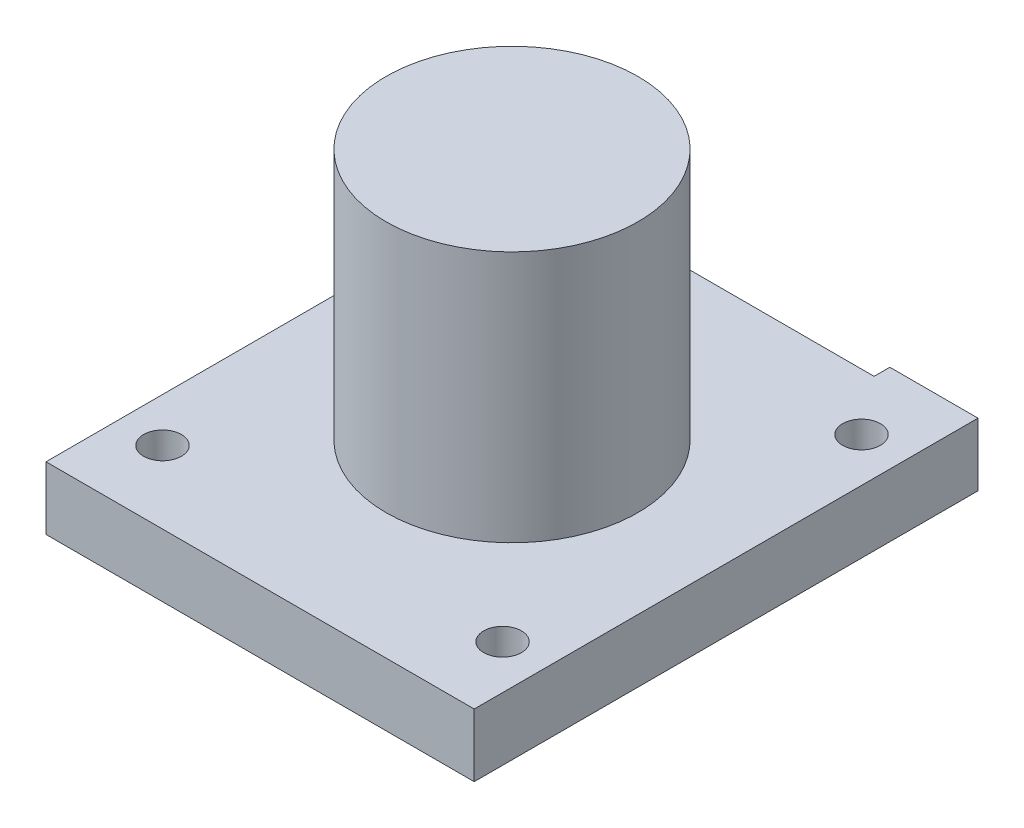
ISO-10303-21;
HEADER;
FILE_DESCRIPTION(('STEP AP214'),'2;1');
FILE_NAME('part.step','',(''),(''),'','','');
FILE_SCHEMA(('AUTOMOTIVE_DESIGN { 1 0 10303 214 1 1 1 1 }'));
ENDSEC;
DATA;
#1=APPLICATION_CONTEXT('core data for automotive mechanical design processes');
#2=APPLICATION_PROTOCOL_DEFINITION('international standard','automotive_design',2000,#1);
#3=PRODUCT_CONTEXT('',#1,'mechanical');
#4=PRODUCT('Part','Part','',(#3));
#5=PRODUCT_RELATED_PRODUCT_CATEGORY('part','',(#4));
#6=PRODUCT_DEFINITION_FORMATION('','',#4);
#7=PRODUCT_DEFINITION_CONTEXT('part definition',#1,'design');
#8=PRODUCT_DEFINITION('design','',#6,#7);
#9=PRODUCT_DEFINITION_SHAPE('','',#8);
#10=(LENGTH_UNIT() NAMED_UNIT(*) SI_UNIT(.MILLI.,.METRE.));
#11=(NAMED_UNIT(*) PLANE_ANGLE_UNIT() SI_UNIT($,.RADIAN.));
#12=(NAMED_UNIT(*) SI_UNIT($,.STERADIAN.) SOLID_ANGLE_UNIT());
#13=UNCERTAINTY_MEASURE_WITH_UNIT(LENGTH_MEASURE(1.E-05),#10,'distance_accuracy_value','');
#14=(GEOMETRIC_REPRESENTATION_CONTEXT(3) GLOBAL_UNCERTAINTY_ASSIGNED_CONTEXT((#13)) GLOBAL_UNIT_ASSIGNED_CONTEXT((#10,
#11,#12)) REPRESENTATION_CONTEXT('',''));
#15=CARTESIAN_POINT('',(0.,0.,0.));
#16=DIRECTION('',(0.,0.,1.));
#17=DIRECTION('',(1.,0.,0.));
#18=AXIS2_PLACEMENT_3D('',#15,#16,#17);
#19=CARTESIAN_POINT('',(0.,-5.,-32.));
#20=DIRECTION('',(0.,0.,-1.));
#21=DIRECTION('',(-1.,0.,0.));
#22=AXIS2_PLACEMENT_3D('',#19,#20,#21);
#23=PLANE('',#22);
#24=DIRECTION('',(-1.,0.,0.));
#25=VECTOR('',#24,1.);
#26=CARTESIAN_POINT('',(0.,0.,-32.));
#27=LINE('',#26,#25);
#28=CARTESIAN_POINT('',(2.,0.,-32.));
#29=VERTEX_POINT('',#28);
#30=CARTESIAN_POINT('',(-5.,0.,-32.));
#31=VERTEX_POINT('',#30);
#32=EDGE_CURVE('E153',#29,#31,#27,.T.);
#33=ORIENTED_EDGE('',*,*,#32,.F.);
#34=DIRECTION('',(0.,1.,0.));
#35=VECTOR('',#34,1.);
#36=CARTESIAN_POINT('',(2.,-5.,-32.));
#37=LINE('',#36,#35);
#38=CARTESIAN_POINT('',(2.,-5.,-32.));
#39=VERTEX_POINT('',#38);
#40=EDGE_CURVE('E12',#39,#29,#37,.T.);
#41=ORIENTED_EDGE('',*,*,#40,.F.);
#42=DIRECTION('',(-1.,0.,0.));
#43=VECTOR('',#42,1.);
#44=CARTESIAN_POINT('',(0.,-5.,-32.));
#45=LINE('',#44,#43);
#46=CARTESIAN_POINT('',(-5.,-5.,-32.));
#47=VERTEX_POINT('',#46);
#48=EDGE_CURVE('E176',#39,#47,#45,.T.);
#49=ORIENTED_EDGE('',*,*,#48,.T.);
#50=DIRECTION('',(0.,1.,0.));
#51=VECTOR('',#50,1.);
#52=CARTESIAN_POINT('',(-5.,-5.,-32.));
#53=LINE('',#52,#51);
#54=EDGE_CURVE('E49',#47,#31,#53,.T.);
#55=ORIENTED_EDGE('',*,*,#54,.T.);
#56=EDGE_LOOP('',(#33,#41,#49,#55));
#57=FACE_BOUND('',#56,.T.);
#58=ADVANCED_FACE('F45',(#57),#23,.T.);
#59=CARTESIAN_POINT('',(2.,-5.,0.));
#60=DIRECTION('',(1.,0.,0.));
#61=DIRECTION('',(0.,0.,-1.));
#62=AXIS2_PLACEMENT_3D('',#59,#60,#61);
#63=PLANE('',#62);
#64=DIRECTION('',(0.,0.,-1.));
#65=VECTOR('',#64,1.);
#66=CARTESIAN_POINT('',(2.,0.,0.));
#67=LINE('',#66,#65);
#68=CARTESIAN_POINT('',(2.,0.,-30.75));
#69=VERTEX_POINT('',#68);
#70=EDGE_CURVE('E171',#69,#29,#67,.T.);
#71=ORIENTED_EDGE('',*,*,#70,.F.);
#72=DIRECTION('',(0.,1.,0.));
#73=VECTOR('',#72,1.);
#74=CARTESIAN_POINT('',(2.,-5.,-30.75));
#75=LINE('',#74,#73);
#76=CARTESIAN_POINT('',(2.,-5.,-30.75));
#77=VERTEX_POINT('',#76);
#78=EDGE_CURVE('E55',#77,#69,#75,.T.);
#79=ORIENTED_EDGE('',*,*,#78,.F.);
#80=DIRECTION('',(0.,0.,-1.));
#81=VECTOR('',#80,1.);
#82=CARTESIAN_POINT('',(2.,-5.,0.));
#83=LINE('',#82,#81);
#84=EDGE_CURVE('E133',#77,#39,#83,.T.);
#85=ORIENTED_EDGE('',*,*,#84,.T.);
#86=ORIENTED_EDGE('',*,*,#40,.T.);
#87=EDGE_LOOP('',(#71,#79,#85,#86));
#88=FACE_BOUND('',#87,.T.);
#89=ADVANCED_FACE('F203',(#88),#63,.T.);
#90=CARTESIAN_POINT('',(0.,-5.,-30.75));
#91=DIRECTION('',(0.,0.,1.));
#92=DIRECTION('',(1.,0.,0.));
#93=AXIS2_PLACEMENT_3D('',#90,#91,#92);
#94=PLANE('',#93);
#95=DIRECTION('',(1.,0.,0.));
#96=VECTOR('',#95,1.);
#97=CARTESIAN_POINT('',(0.,0.,-30.75));
#98=LINE('',#97,#96);
#99=CARTESIAN_POINT('',(22.,0.,-30.75));
#100=VERTEX_POINT('',#99);
#101=EDGE_CURVE('E136',#69,#100,#98,.T.);
#102=ORIENTED_EDGE('',*,*,#101,.T.);
#103=DIRECTION('',(0.,1.,0.));
#104=VECTOR('',#103,1.);
#105=CARTESIAN_POINT('',(22.,-5.,-30.75));
#106=LINE('',#105,#104);
#107=CARTESIAN_POINT('',(22.,-5.,-30.75));
#108=VERTEX_POINT('',#107);
#109=EDGE_CURVE('E124',#108,#100,#106,.T.);
#110=ORIENTED_EDGE('',*,*,#109,.F.);
#111=DIRECTION('',(1.,0.,0.));
#112=VECTOR('',#111,1.);
#113=CARTESIAN_POINT('',(0.,-5.,-30.75));
#114=LINE('',#113,#112);
#115=EDGE_CURVE('E128',#77,#108,#114,.T.);
#116=ORIENTED_EDGE('',*,*,#115,.F.);
#117=ORIENTED_EDGE('',*,*,#78,.T.);
#118=EDGE_LOOP('',(#102,#110,#116,#117));
#119=FACE_BOUND('',#118,.T.);
#120=ADVANCED_FACE('F135',(#119),#94,.F.);
#121=CARTESIAN_POINT('',(22.,-5.,0.));
#122=DIRECTION('',(1.,0.,0.));
#123=DIRECTION('',(0.,0.,-1.));
#124=AXIS2_PLACEMENT_3D('',#121,#122,#123);
#125=PLANE('',#124);
#126=DIRECTION('',(0.,0.,-1.));
#127=VECTOR('',#126,1.);
#128=CARTESIAN_POINT('',(22.,0.,0.));
#129=LINE('',#128,#127);
#130=CARTESIAN_POINT('',(22.,0.,-32.));
#131=VERTEX_POINT('',#130);
#132=EDGE_CURVE('E168',#100,#131,#129,.T.);
#133=ORIENTED_EDGE('',*,*,#132,.T.);
#134=DIRECTION('',(0.,1.,0.));
#135=VECTOR('',#134,1.);
#136=CARTESIAN_POINT('',(22.,-5.,-32.));
#137=LINE('',#136,#135);
#138=CARTESIAN_POINT('',(22.,-5.,-32.));
#139=VERTEX_POINT('',#138);
#140=EDGE_CURVE('E125',#139,#131,#137,.T.);
#141=ORIENTED_EDGE('',*,*,#140,.F.);
#142=DIRECTION('',(0.,0.,-1.));
#143=VECTOR('',#142,1.);
#144=CARTESIAN_POINT('',(22.,-5.,0.));
#145=LINE('',#144,#143);
#146=EDGE_CURVE('E119',#108,#139,#145,.T.);
#147=ORIENTED_EDGE('',*,*,#146,.F.);
#148=ORIENTED_EDGE('',*,*,#109,.T.);
#149=EDGE_LOOP('',(#133,#141,#147,#148));
#150=FACE_BOUND('',#149,.T.);
#151=ADVANCED_FACE('F122',(#150),#125,.F.);
#152=CARTESIAN_POINT('',(0.,-5.,-32.));
#153=DIRECTION('',(0.,0.,-1.));
#154=DIRECTION('',(-1.,0.,0.));
#155=AXIS2_PLACEMENT_3D('',#152,#153,#154);
#156=PLANE('',#155);
#157=DIRECTION('',(-1.,0.,0.));
#158=VECTOR('',#157,1.);
#159=CARTESIAN_POINT('',(0.,0.,-32.));
#160=LINE('',#159,#158);
#161=CARTESIAN_POINT('',(29.,0.,-32.));
#162=VERTEX_POINT('',#161);
#163=EDGE_CURVE('E165',#162,#131,#160,.T.);
#164=ORIENTED_EDGE('',*,*,#163,.F.);
#165=DIRECTION('',(0.,1.,0.));
#166=VECTOR('',#165,1.);
#167=CARTESIAN_POINT('',(29.,-5.,-32.));
#168=LINE('',#167,#166);
#169=CARTESIAN_POINT('',(29.,-5.,-32.));
#170=VERTEX_POINT('',#169);
#171=EDGE_CURVE('E139',#170,#162,#168,.T.);
#172=ORIENTED_EDGE('',*,*,#171,.F.);
#173=DIRECTION('',(-1.,0.,0.));
#174=VECTOR('',#173,1.);
#175=CARTESIAN_POINT('',(0.,-5.,-32.));
#176=LINE('',#175,#174);
#177=EDGE_CURVE('E129',#170,#139,#176,.T.);
#178=ORIENTED_EDGE('',*,*,#177,.T.);
#179=ORIENTED_EDGE('',*,*,#140,.T.);
#180=EDGE_LOOP('',(#164,#172,#178,#179));
#181=FACE_BOUND('',#180,.T.);
#182=ADVANCED_FACE('F193',(#181),#156,.T.);
#183=CARTESIAN_POINT('',(29.,-5.,0.));
#184=DIRECTION('',(1.,0.,0.));
#185=DIRECTION('',(0.,0.,-1.));
#186=AXIS2_PLACEMENT_3D('',#183,#184,#185);
#187=PLANE('',#186);
#188=DIRECTION('',(0.,0.,-1.));
#189=VECTOR('',#188,1.);
#190=CARTESIAN_POINT('',(29.,0.,0.));
#191=LINE('',#190,#189);
#192=CARTESIAN_POINT('',(29.,0.,8.00000000000001));
#193=VERTEX_POINT('',#192);
#194=EDGE_CURVE('E162',#193,#162,#191,.T.);
#195=ORIENTED_EDGE('',*,*,#194,.F.);
#196=DIRECTION('',(0.,1.,0.));
#197=VECTOR('',#196,1.);
#198=CARTESIAN_POINT('',(29.,-5.,8.00000000000001));
#199=LINE('',#198,#197);
#200=CARTESIAN_POINT('',(29.,-5.,8.00000000000001));
#201=VERTEX_POINT('',#200);
#202=EDGE_CURVE('E143',#201,#193,#199,.T.);
#203=ORIENTED_EDGE('',*,*,#202,.F.);
#204=DIRECTION('',(0.,0.,-1.));
#205=VECTOR('',#204,1.);
#206=CARTESIAN_POINT('',(29.,-5.,0.));
#207=LINE('',#206,#205);
#208=EDGE_CURVE('E188',#201,#170,#207,.T.);
#209=ORIENTED_EDGE('',*,*,#208,.T.);
#210=ORIENTED_EDGE('',*,*,#171,.T.);
#211=EDGE_LOOP('',(#195,#203,#209,#210));
#212=FACE_BOUND('',#211,.T.);
#213=ADVANCED_FACE('F197',(#212),#187,.T.);
#214=CARTESIAN_POINT('',(0.,-5.,8.));
#215=DIRECTION('',(0.,0.,1.));
#216=DIRECTION('',(1.,0.,0.));
#217=AXIS2_PLACEMENT_3D('',#214,#215,#216);
#218=PLANE('',#217);
#219=DIRECTION('',(1.,0.,0.));
#220=VECTOR('',#219,1.);
#221=CARTESIAN_POINT('',(0.,0.,8.));
#222=LINE('',#221,#220);
#223=CARTESIAN_POINT('',(-5.,0.,8.));
#224=VERTEX_POINT('',#223);
#225=EDGE_CURVE('E159',#224,#193,#222,.T.);
#226=ORIENTED_EDGE('',*,*,#225,.F.);
#227=DIRECTION('',(0.,1.,0.));
#228=VECTOR('',#227,1.);
#229=CARTESIAN_POINT('',(-5.,-5.,8.));
#230=LINE('',#229,#228);
#231=CARTESIAN_POINT('',(-5.,-5.,8.));
#232=VERTEX_POINT('',#231);
#233=EDGE_CURVE('E144',#232,#224,#230,.T.);
#234=ORIENTED_EDGE('',*,*,#233,.F.);
#235=DIRECTION('',(1.,0.,0.));
#236=VECTOR('',#235,1.);
#237=CARTESIAN_POINT('',(0.,-5.,8.));
#238=LINE('',#237,#236);
#239=EDGE_CURVE('E185',#232,#201,#238,.T.);
#240=ORIENTED_EDGE('',*,*,#239,.T.);
#241=ORIENTED_EDGE('',*,*,#202,.T.);
#242=EDGE_LOOP('',(#226,#234,#240,#241));
#243=FACE_BOUND('',#242,.T.);
#244=ADVANCED_FACE('F200',(#243),#218,.T.);
#245=CARTESIAN_POINT('',(12.,-5.,-12.));
#246=DIRECTION('',(0.,1.,0.));
#247=DIRECTION('',(0.,0.,1.));
#248=AXIS2_PLACEMENT_3D('',#245,#246,#247);
#249=CYLINDRICAL_SURFACE('',#248,10.);
#250=CARTESIAN_POINT('',(12.,-5.,-12.));
#251=DIRECTION('',(0.,1.,0.));
#252=DIRECTION('',(0.,0.,1.));
#253=AXIS2_PLACEMENT_3D('',#250,#251,#252);
#254=CIRCLE('',#253,10.);
#255=CARTESIAN_POINT('',(12.,-5.,-1.99999999999999));
#256=VERTEX_POINT('',#255);
#257=EDGE_CURVE('E173',#256,#256,#254,.T.);
#258=ORIENTED_EDGE('',*,*,#257,.F.);
#259=EDGE_LOOP('',(#258));
#260=FACE_BOUND('',#259,.T.);
#261=CARTESIAN_POINT('',(12.,0.,-12.));
#262=DIRECTION('',(0.,1.,0.));
#263=DIRECTION('',(0.,0.,1.));
#264=AXIS2_PLACEMENT_3D('',#261,#262,#263);
#265=CIRCLE('',#264,10.);
#266=CARTESIAN_POINT('',(12.,0.,-1.99999999999999));
#267=VERTEX_POINT('',#266);
#268=EDGE_CURVE('E150',#267,#267,#265,.T.);
#269=ORIENTED_EDGE('',*,*,#268,.T.);
#270=EDGE_LOOP('',(#269));
#271=FACE_BOUND('',#270,.T.);
#272=ADVANCED_FACE('F47',(#260,#271),#249,.F.);
#273=CARTESIAN_POINT('',(-5.,-5.,0.));
#274=DIRECTION('',(1.,0.,0.));
#275=DIRECTION('',(0.,0.,-1.));
#276=AXIS2_PLACEMENT_3D('',#273,#274,#275);
#277=PLANE('',#276);
#278=DIRECTION('',(0.,0.,-1.));
#279=VECTOR('',#278,1.);
#280=CARTESIAN_POINT('',(-5.,0.,0.));
#281=LINE('',#280,#279);
#282=EDGE_CURVE('E157',#224,#31,#281,.T.);
#283=ORIENTED_EDGE('',*,*,#282,.T.);
#284=ORIENTED_EDGE('',*,*,#54,.F.);
#285=DIRECTION('',(0.,0.,-1.));
#286=VECTOR('',#285,1.);
#287=CARTESIAN_POINT('',(-5.,-5.,0.));
#288=LINE('',#287,#286);
#289=EDGE_CURVE('E102',#232,#47,#288,.T.);
#290=ORIENTED_EDGE('',*,*,#289,.F.);
#291=ORIENTED_EDGE('',*,*,#233,.T.);
#292=EDGE_LOOP('',(#283,#284,#290,#291));
#293=FACE_BOUND('',#292,.T.);
#294=ADVANCED_FACE('F201',(#293),#277,.F.);
#295=CARTESIAN_POINT('',(0.,-5.,0.));
#296=DIRECTION('',(0.,1.,0.));
#297=DIRECTION('',(0.,0.,1.));
#298=AXIS2_PLACEMENT_3D('',#295,#296,#297);
#299=PLANE('',#298);
#300=CARTESIAN_POINT('',(-1.50000000000001,-5.,2.24999999999999));
#301=DIRECTION('',(0.,1.,0.));
#302=DIRECTION('',(0.,0.,1.));
#303=AXIS2_PLACEMENT_3D('',#300,#301,#302);
#304=CIRCLE('',#303,1.5);
#305=CARTESIAN_POINT('',(-1.50000000000001,-5.,3.74999999999999));
#306=VERTEX_POINT('',#305);
#307=EDGE_CURVE('E251',#306,#306,#304,.T.);
#308=ORIENTED_EDGE('',*,*,#307,.T.);
#309=EDGE_LOOP('',(#308));
#310=FACE_BOUND('',#309,.T.);
#311=CARTESIAN_POINT('',(25.5,-5.,2.24999999999999));
#312=DIRECTION('',(0.,1.,0.));
#313=DIRECTION('',(0.,0.,1.));
#314=AXIS2_PLACEMENT_3D('',#311,#312,#313);
#315=CIRCLE('',#314,1.5);
#316=CARTESIAN_POINT('',(25.5,-5.,3.74999999999999));
#317=VERTEX_POINT('',#316);
#318=EDGE_CURVE('E253',#317,#317,#315,.T.);
#319=ORIENTED_EDGE('',*,*,#318,.T.);
#320=EDGE_LOOP('',(#319));
#321=FACE_BOUND('',#320,.T.);
#322=CARTESIAN_POINT('',(25.5,-5.,-26.25));
#323=DIRECTION('',(0.,1.,0.));
#324=DIRECTION('',(0.,0.,1.));
#325=AXIS2_PLACEMENT_3D('',#322,#323,#324);
#326=CIRCLE('',#325,1.5);
#327=CARTESIAN_POINT('',(25.5,-5.,-24.75));
#328=VERTEX_POINT('',#327);
#329=EDGE_CURVE('E257',#328,#328,#326,.T.);
#330=ORIENTED_EDGE('',*,*,#329,.T.);
#331=EDGE_LOOP('',(#330));
#332=FACE_BOUND('',#331,.T.);
#333=CARTESIAN_POINT('',(-1.50000000000001,-5.,-26.25));
#334=DIRECTION('',(0.,1.,0.));
#335=DIRECTION('',(0.,0.,1.));
#336=AXIS2_PLACEMENT_3D('',#333,#334,#335);
#337=CIRCLE('',#336,1.5);
#338=CARTESIAN_POINT('',(-1.50000000000001,-5.,-24.75));
#339=VERTEX_POINT('',#338);
#340=EDGE_CURVE('E154',#339,#339,#337,.T.);
#341=ORIENTED_EDGE('',*,*,#340,.T.);
#342=EDGE_LOOP('',(#341));
#343=FACE_BOUND('',#342,.T.);
#344=ORIENTED_EDGE('',*,*,#257,.T.);
#345=EDGE_LOOP('',(#344));
#346=FACE_BOUND('',#345,.T.);
#347=ORIENTED_EDGE('',*,*,#48,.F.);
#348=ORIENTED_EDGE('',*,*,#84,.F.);
#349=ORIENTED_EDGE('',*,*,#115,.T.);
#350=ORIENTED_EDGE('',*,*,#146,.T.);
#351=ORIENTED_EDGE('',*,*,#177,.F.);
#352=ORIENTED_EDGE('',*,*,#208,.F.);
#353=ORIENTED_EDGE('',*,*,#239,.F.);
#354=ORIENTED_EDGE('',*,*,#289,.T.);
#355=EDGE_LOOP('',(#347,#348,#349,#350,#351,#352,#353,#354));
#356=FACE_BOUND('',#355,.T.);
#357=ADVANCED_FACE('F132',(#310,#321,#332,#343,#346,#356),#299,.F.);
#358=CARTESIAN_POINT('',(0.,0.,0.));
#359=DIRECTION('',(0.,1.,0.));
#360=DIRECTION('',(0.,0.,1.));
#361=AXIS2_PLACEMENT_3D('',#358,#359,#360);
#362=PLANE('',#361);
#363=CARTESIAN_POINT('',(-1.50000000000001,0.,2.24999999999999));
#364=DIRECTION('',(0.,1.,0.));
#365=DIRECTION('',(0.,0.,-1.));
#366=AXIS2_PLACEMENT_3D('',#363,#364,#365);
#367=CIRCLE('',#366,1.5);
#368=CARTESIAN_POINT('',(-1.50000000000001,0.,0.749999999999989));
#369=VERTEX_POINT('',#368);
#370=EDGE_CURVE('E248',#369,#369,#367,.T.);
#371=ORIENTED_EDGE('',*,*,#370,.F.);
#372=EDGE_LOOP('',(#371));
#373=FACE_BOUND('',#372,.T.);
#374=CARTESIAN_POINT('',(25.5,0.,2.24999999999999));
#375=DIRECTION('',(0.,1.,0.));
#376=DIRECTION('',(0.,0.,1.));
#377=AXIS2_PLACEMENT_3D('',#374,#375,#376);
#378=CIRCLE('',#377,1.5);
#379=CARTESIAN_POINT('',(25.5,0.,3.74999999999999));
#380=VERTEX_POINT('',#379);
#381=EDGE_CURVE('E265',#380,#380,#378,.T.);
#382=ORIENTED_EDGE('',*,*,#381,.F.);
#383=EDGE_LOOP('',(#382));
#384=FACE_BOUND('',#383,.T.);
#385=CARTESIAN_POINT('',(25.5,0.,-26.25));
#386=DIRECTION('',(0.,1.,0.));
#387=DIRECTION('',(0.,0.,-1.));
#388=AXIS2_PLACEMENT_3D('',#385,#386,#387);
#389=CIRCLE('',#388,1.5);
#390=CARTESIAN_POINT('',(25.5,0.,-27.75));
#391=VERTEX_POINT('',#390);
#392=EDGE_CURVE('E262',#391,#391,#389,.T.);
#393=ORIENTED_EDGE('',*,*,#392,.F.);
#394=EDGE_LOOP('',(#393));
#395=FACE_BOUND('',#394,.T.);
#396=CARTESIAN_POINT('',(-1.50000000000001,0.,-26.25));
#397=DIRECTION('',(0.,1.,0.));
#398=DIRECTION('',(0.,0.,1.));
#399=AXIS2_PLACEMENT_3D('',#396,#397,#398);
#400=CIRCLE('',#399,1.5);
#401=CARTESIAN_POINT('',(-1.50000000000001,0.,-24.75));
#402=VERTEX_POINT('',#401);
#403=EDGE_CURVE('E252',#402,#402,#400,.T.);
#404=ORIENTED_EDGE('',*,*,#403,.F.);
#405=EDGE_LOOP('',(#404));
#406=FACE_BOUND('',#405,.T.);
#407=ORIENTED_EDGE('',*,*,#268,.F.);
#408=EDGE_LOOP('',(#407));
#409=FACE_BOUND('',#408,.T.);
#410=ORIENTED_EDGE('',*,*,#32,.T.);
#411=ORIENTED_EDGE('',*,*,#282,.F.);
#412=ORIENTED_EDGE('',*,*,#225,.T.);
#413=ORIENTED_EDGE('',*,*,#194,.T.);
#414=ORIENTED_EDGE('',*,*,#163,.T.);
#415=ORIENTED_EDGE('',*,*,#132,.F.);
#416=ORIENTED_EDGE('',*,*,#101,.F.);
#417=ORIENTED_EDGE('',*,*,#70,.T.);
#418=EDGE_LOOP('',(#410,#411,#412,#413,#414,#415,#416,#417));
#419=FACE_BOUND('',#418,.T.);
#420=ADVANCED_FACE('F221',(#373,#384,#395,#406,#409,#419),#362,.T.);
#421=CARTESIAN_POINT('',(-1.50000000000001,-10.,-26.25));
#422=DIRECTION('',(0.,1.,0.));
#423=DIRECTION('',(0.,0.,1.));
#424=AXIS2_PLACEMENT_3D('',#421,#422,#423);
#425=CYLINDRICAL_SURFACE('',#424,1.5);
#426=ORIENTED_EDGE('',*,*,#403,.T.);
#427=EDGE_LOOP('',(#426));
#428=FACE_BOUND('',#427,.T.);
#429=ORIENTED_EDGE('',*,*,#340,.F.);
#430=EDGE_LOOP('',(#429));
#431=FACE_BOUND('',#430,.T.);
#432=ADVANCED_FACE('F224',(#428,#431),#425,.F.);
#433=CARTESIAN_POINT('',(25.5,-10.,-26.25));
#434=DIRECTION('',(0.,1.,0.));
#435=DIRECTION('',(0.,0.,1.));
#436=AXIS2_PLACEMENT_3D('',#433,#434,#435);
#437=CYLINDRICAL_SURFACE('',#436,1.5);
#438=ORIENTED_EDGE('',*,*,#392,.T.);
#439=EDGE_LOOP('',(#438));
#440=FACE_BOUND('',#439,.T.);
#441=ORIENTED_EDGE('',*,*,#329,.F.);
#442=EDGE_LOOP('',(#441));
#443=FACE_BOUND('',#442,.T.);
#444=ADVANCED_FACE('F231',(#440,#443),#437,.F.);
#445=CARTESIAN_POINT('',(25.5,-10.,2.24999999999999));
#446=DIRECTION('',(0.,1.,0.));
#447=DIRECTION('',(0.,0.,1.));
#448=AXIS2_PLACEMENT_3D('',#445,#446,#447);
#449=CYLINDRICAL_SURFACE('',#448,1.5);
#450=ORIENTED_EDGE('',*,*,#381,.T.);
#451=EDGE_LOOP('',(#450));
#452=FACE_BOUND('',#451,.T.);
#453=ORIENTED_EDGE('',*,*,#318,.F.);
#454=EDGE_LOOP('',(#453));
#455=FACE_BOUND('',#454,.T.);
#456=ADVANCED_FACE('F235',(#452,#455),#449,.F.);
#457=CARTESIAN_POINT('',(-1.50000000000001,-10.,2.24999999999999));
#458=DIRECTION('',(0.,1.,0.));
#459=DIRECTION('',(0.,0.,1.));
#460=AXIS2_PLACEMENT_3D('',#457,#458,#459);
#461=CYLINDRICAL_SURFACE('',#460,1.5);
#462=ORIENTED_EDGE('',*,*,#370,.T.);
#463=EDGE_LOOP('',(#462));
#464=FACE_BOUND('',#463,.T.);
#465=ORIENTED_EDGE('',*,*,#307,.F.);
#466=EDGE_LOOP('',(#465));
#467=FACE_BOUND('',#466,.T.);
#468=ADVANCED_FACE('F239',(#464,#467),#461,.F.);
#469=CLOSED_SHELL('',(#58,#89,#120,#151,#182,#213,#244,#272,#294,#357,#420,#432,#444,#456,#468));
#470=MANIFOLD_SOLID_BREP('B2',#469);
#471=CARTESIAN_POINT('',(12.,20.,-12.));
#472=DIRECTION('',(0.,-1.,0.));
#473=DIRECTION('',(0.,0.,-1.));
#474=AXIS2_PLACEMENT_3D('',#471,#472,#473);
#475=CYLINDRICAL_SURFACE('',#474,10.);
#476=CARTESIAN_POINT('',(12.,20.,-12.));
#477=DIRECTION('',(0.,1.,0.));
#478=DIRECTION('',(0.,0.,1.));
#479=AXIS2_PLACEMENT_3D('',#476,#477,#478);
#480=CIRCLE('',#479,10.);
#481=CARTESIAN_POINT('',(12.,20.,-1.99999999999999));
#482=VERTEX_POINT('',#481);
#483=EDGE_CURVE('E44',#482,#482,#480,.T.);
#484=ORIENTED_EDGE('',*,*,#483,.F.);
#485=EDGE_LOOP('',(#484));
#486=FACE_BOUND('',#485,.T.);
#487=CARTESIAN_POINT('',(12.,-3.,-12.));
#488=DIRECTION('',(0.,1.,0.));
#489=DIRECTION('',(0.,0.,1.));
#490=AXIS2_PLACEMENT_3D('',#487,#488,#489);
#491=CIRCLE('',#490,10.);
#492=CARTESIAN_POINT('',(12.,-3.,-1.99999999999999));
#493=VERTEX_POINT('',#492);
#494=EDGE_CURVE('E393',#493,#493,#491,.T.);
#495=ORIENTED_EDGE('',*,*,#494,.T.);
#496=EDGE_LOOP('',(#495));
#497=FACE_BOUND('',#496,.T.);
#498=ADVANCED_FACE('F387',(#486,#497),#475,.T.);
#499=CARTESIAN_POINT('',(0.,20.,0.));
#500=DIRECTION('',(0.,1.,0.));
#501=DIRECTION('',(0.,0.,1.));
#502=AXIS2_PLACEMENT_3D('',#499,#500,#501);
#503=PLANE('',#502);
#504=ORIENTED_EDGE('',*,*,#483,.T.);
#505=EDGE_LOOP('',(#504));
#506=FACE_BOUND('',#505,.T.);
#507=ADVANCED_FACE('F402',(#506),#503,.T.);
#508=CARTESIAN_POINT('',(0.,-3.,0.));
#509=DIRECTION('',(0.,1.,0.));
#510=DIRECTION('',(0.,0.,1.));
#511=AXIS2_PLACEMENT_3D('',#508,#509,#510);
#512=PLANE('',#511);
#513=ORIENTED_EDGE('',*,*,#494,.F.);
#514=EDGE_LOOP('',(#513));
#515=FACE_BOUND('',#514,.T.);
#516=ADVANCED_FACE('F400',(#515),#512,.F.);
#517=CLOSED_SHELL('',(#498,#507,#516));
#518=MANIFOLD_SOLID_BREP('B6',#517);
#519=ADVANCED_BREP_SHAPE_REPRESENTATION('',(#18,#470,#518),#14);
#520=SHAPE_DEFINITION_REPRESENTATION(#9,#519);
ENDSEC;
END-ISO-10303-21;
